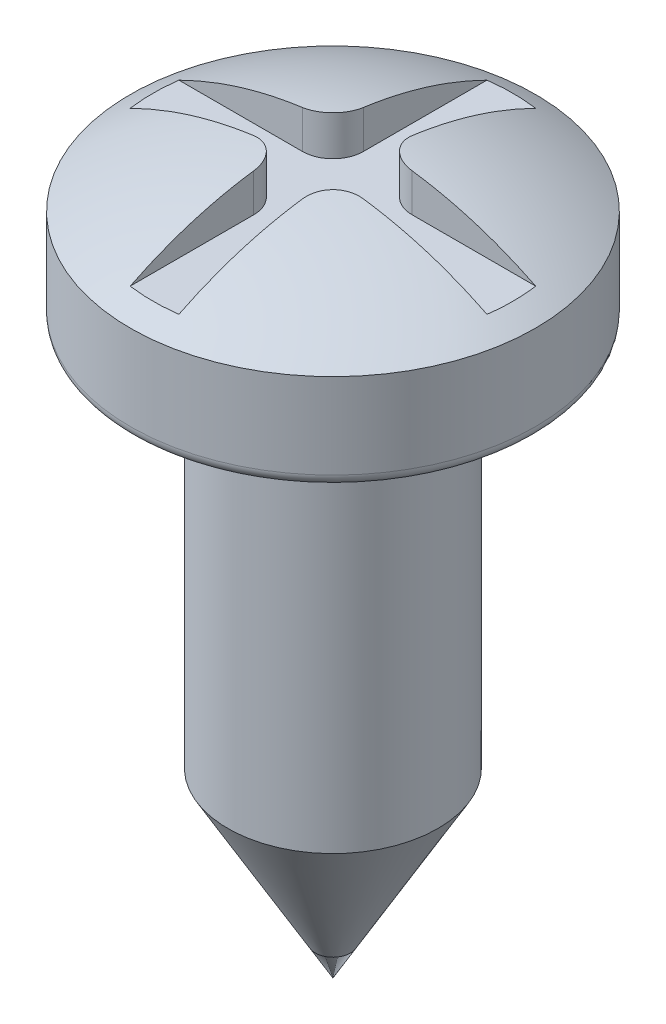
ISO-10303-21;
HEADER;
FILE_DESCRIPTION(('STEP AP214'),'2;1');
FILE_NAME('part.step','',(''),(''),'','','');
FILE_SCHEMA(('AUTOMOTIVE_DESIGN { 1 0 10303 214 1 1 1 1 }'));
ENDSEC;
DATA;
#1=APPLICATION_CONTEXT('core data for automotive mechanical design processes');
#2=APPLICATION_PROTOCOL_DEFINITION('international standard','automotive_design',2000,#1);
#3=PRODUCT_CONTEXT('',#1,'mechanical');
#4=PRODUCT('Part','Part','',(#3));
#5=PRODUCT_RELATED_PRODUCT_CATEGORY('part','',(#4));
#6=PRODUCT_DEFINITION_FORMATION('','',#4);
#7=PRODUCT_DEFINITION_CONTEXT('part definition',#1,'design');
#8=PRODUCT_DEFINITION('design','',#6,#7);
#9=PRODUCT_DEFINITION_SHAPE('','',#8);
#10=(LENGTH_UNIT() NAMED_UNIT(*) SI_UNIT(.MILLI.,.METRE.));
#11=(NAMED_UNIT(*) PLANE_ANGLE_UNIT() SI_UNIT($,.RADIAN.));
#12=(NAMED_UNIT(*) SI_UNIT($,.STERADIAN.) SOLID_ANGLE_UNIT());
#13=UNCERTAINTY_MEASURE_WITH_UNIT(LENGTH_MEASURE(1.E-05),#10,'distance_accuracy_value','');
#14=(GEOMETRIC_REPRESENTATION_CONTEXT(3) GLOBAL_UNCERTAINTY_ASSIGNED_CONTEXT((#13)) GLOBAL_UNIT_ASSIGNED_CONTEXT((#10,
#11,#12)) REPRESENTATION_CONTEXT('',''));
#15=CARTESIAN_POINT('',(0.,0.,0.));
#16=DIRECTION('',(0.,0.,1.));
#17=DIRECTION('',(1.,0.,0.));
#18=AXIS2_PLACEMENT_3D('',#15,#16,#17);
#19=CARTESIAN_POINT('',(0.,0.,0.));
#20=DIRECTION('',(0.,1.,0.));
#21=DIRECTION('',(-1.,0.,0.));
#22=AXIS2_PLACEMENT_3D('',#19,#20,#21);
#23=CONICAL_SURFACE('',#22,0.,0.523598775598293);
#24=CARTESIAN_POINT('',(0.,2.98778764305636,0.));
#25=DIRECTION('',(0.,-1.,0.));
#26=DIRECTION('',(1.,0.,0.));
#27=AXIS2_PLACEMENT_3D('',#24,#25,#26);
#28=CIRCLE('',#27,1.725);
#29=CARTESIAN_POINT('',(1.725,2.98778764305636,0.));
#30=VERTEX_POINT('',#29);
#31=EDGE_CURVE('E247',#30,#30,#28,.T.);
#32=ORIENTED_EDGE('',*,*,#31,.T.);
#33=EDGE_LOOP('',(#32));
#34=FACE_BOUND('',#33,.T.);
#35=CARTESIAN_POINT('',(0.,0.,0.));
#36=VERTEX_POINT('',#35);
#37=VERTEX_LOOP('',#36);
#38=FACE_BOUND('',#37,.T.);
#39=ADVANCED_FACE('F38',(#34,#38),#23,.T.);
#40=CARTESIAN_POINT('',(0.,0.,0.));
#41=DIRECTION('',(0.,-1.,0.));
#42=DIRECTION('',(1.,0.,0.));
#43=AXIS2_PLACEMENT_3D('',#40,#41,#42);
#44=CYLINDRICAL_SURFACE('',#43,1.725);
#45=CARTESIAN_POINT('',(0.,9.3,0.));
#46=DIRECTION('',(0.,-1.,0.));
#47=DIRECTION('',(1.,0.,0.));
#48=AXIS2_PLACEMENT_3D('',#45,#46,#47);
#49=CIRCLE('',#48,1.725);
#50=CARTESIAN_POINT('',(1.725,9.3,0.));
#51=VERTEX_POINT('',#50);
#52=EDGE_CURVE('E243',#51,#51,#49,.T.);
#53=ORIENTED_EDGE('',*,*,#52,.T.);
#54=EDGE_LOOP('',(#53));
#55=FACE_BOUND('',#54,.T.);
#56=ORIENTED_EDGE('',*,*,#31,.F.);
#57=EDGE_LOOP('',(#56));
#58=FACE_BOUND('',#57,.T.);
#59=ADVANCED_FACE('F329',(#55,#58),#44,.T.);
#60=CARTESIAN_POINT('',(3.125,9.3,0.));
#61=DIRECTION('',(0.,-1.,0.));
#62=DIRECTION('',(1.,0.,0.));
#63=AXIS2_PLACEMENT_3D('',#60,#61,#62);
#64=PLANE('',#63);
#65=CARTESIAN_POINT('',(0.,9.3,0.));
#66=DIRECTION('',(0.,-1.,0.));
#67=DIRECTION('',(1.,0.,0.));
#68=AXIS2_PLACEMENT_3D('',#65,#66,#67);
#69=CIRCLE('',#68,3.125);
#70=CARTESIAN_POINT('',(3.125,9.3,0.));
#71=VERTEX_POINT('',#70);
#72=EDGE_CURVE('E239',#71,#71,#69,.T.);
#73=ORIENTED_EDGE('',*,*,#72,.T.);
#74=EDGE_LOOP('',(#73));
#75=FACE_BOUND('',#74,.T.);
#76=ORIENTED_EDGE('',*,*,#52,.F.);
#77=EDGE_LOOP('',(#76));
#78=FACE_BOUND('',#77,.T.);
#79=ADVANCED_FACE('F334',(#75,#78),#64,.T.);
#80=CARTESIAN_POINT('',(0.,9.5,0.));
#81=DIRECTION('',(0.,-1.,0.));
#82=DIRECTION('',(1.,0.,0.));
#83=AXIS2_PLACEMENT_3D('',#80,#81,#82);
#84=TOROIDAL_SURFACE('',#83,3.125,0.200000000000001);
#85=CARTESIAN_POINT('',(0.,9.5,0.));
#86=DIRECTION('',(0.,-1.,0.));
#87=DIRECTION('',(1.,0.,0.));
#88=AXIS2_PLACEMENT_3D('',#85,#86,#87);
#89=CIRCLE('',#88,3.325);
#90=CARTESIAN_POINT('',(3.325,9.5,0.));
#91=VERTEX_POINT('',#90);
#92=EDGE_CURVE('E235',#91,#91,#89,.T.);
#93=ORIENTED_EDGE('',*,*,#92,.T.);
#94=EDGE_LOOP('',(#93));
#95=FACE_BOUND('',#94,.T.);
#96=ORIENTED_EDGE('',*,*,#72,.F.);
#97=EDGE_LOOP('',(#96));
#98=FACE_BOUND('',#97,.T.);
#99=ADVANCED_FACE('F341',(#95,#98),#84,.T.);
#100=CARTESIAN_POINT('',(0.,0.,0.));
#101=DIRECTION('',(0.,-1.,0.));
#102=DIRECTION('',(1.,0.,0.));
#103=AXIS2_PLACEMENT_3D('',#100,#101,#102);
#104=CYLINDRICAL_SURFACE('',#103,3.325);
#105=CARTESIAN_POINT('',(0.,10.9,0.));
#106=DIRECTION('',(0.,-1.,0.));
#107=DIRECTION('',(1.,0.,0.));
#108=AXIS2_PLACEMENT_3D('',#105,#106,#107);
#109=CIRCLE('',#108,3.325);
#110=CARTESIAN_POINT('',(3.325,10.9,0.));
#111=VERTEX_POINT('',#110);
#112=EDGE_CURVE('E215',#111,#111,#109,.T.);
#113=ORIENTED_EDGE('',*,*,#112,.T.);
#114=EDGE_LOOP('',(#113));
#115=FACE_BOUND('',#114,.T.);
#116=ORIENTED_EDGE('',*,*,#92,.F.);
#117=EDGE_LOOP('',(#116));
#118=FACE_BOUND('',#117,.T.);
#119=ADVANCED_FACE('F346',(#115,#118),#104,.T.);
#120=CARTESIAN_POINT('',(0.,5.20798611111109,0.));
#121=DIRECTION('',(0.,-1.,0.));
#122=DIRECTION('',(1.,0.,0.));
#123=AXIS2_PLACEMENT_3D('',#120,#121,#122);
#124=SPHERICAL_SURFACE('',#123,6.59201388888891);
#125=CARTESIAN_POINT('',(0.,11.1,0.));
#126=DIRECTION('',(0.,-1.,0.));
#127=DIRECTION('',(0.,0.,-1.));
#128=AXIS2_PLACEMENT_3D('',#125,#126,#127);
#129=CIRCLE('',#128,2.9561494286393);
#130=CARTESIAN_POINT('',(-2.92896217873233,11.1,-0.4));
#131=VERTEX_POINT('',#130);
#132=CARTESIAN_POINT('',(-2.92896217873233,11.1,0.4));
#133=VERTEX_POINT('',#132);
#134=EDGE_CURVE('E11',#131,#133,#129,.F.);
#135=ORIENTED_EDGE('',*,*,#134,.F.);
#136=CARTESIAN_POINT('',(0.,5.20798611111109,-0.4));
#137=DIRECTION('',(0.,0.,-1.));
#138=DIRECTION('',(-1.,0.,0.));
#139=AXIS2_PLACEMENT_3D('',#136,#137,#138);
#140=CIRCLE('',#139,6.57986680042266);
#141=CARTESIAN_POINT('',(-0.900000000000004,11.7260108971413,-0.4));
#142=VERTEX_POINT('',#141);
#143=EDGE_CURVE('E41',#142,#131,#140,.F.);
#144=ORIENTED_EDGE('',*,*,#143,.F.);
#145=CARTESIAN_POINT('',(-0.400000040000002,11.7259832758316,-0.900200000000003));
#146=CARTESIAN_POINT('',(-0.399964302893069,11.7298192962777,-0.872454147386038));
#147=CARTESIAN_POINT('',(-0.402286195456468,11.7333328197662,-0.844662243231787));
#148=CARTESIAN_POINT('',(-0.411514871642758,11.7396274742449,-0.789773061416488));
#149=CARTESIAN_POINT('',(-0.418420422207348,11.7424088019235,-0.762675598977974));
#150=CARTESIAN_POINT('',(-0.436694287015601,11.7471559318876,-0.709922826840037));
#151=CARTESIAN_POINT('',(-0.448066564077081,11.749121006811,-0.68426882092428));
#152=CARTESIAN_POINT('',(-0.474960733491131,11.7521725680326,-0.635190983387495));
#153=CARTESIAN_POINT('',(-0.490481074808829,11.7532593821181,-0.611766322605347));
#154=CARTESIAN_POINT('',(-0.525061326747513,11.7545153460377,-0.568051162184408));
#155=CARTESIAN_POINT('',(-0.544084001997458,11.7546936307443,-0.54773146443042));
#156=CARTESIAN_POINT('',(-0.58522961840174,11.754151736038,-0.510527488982345));
#157=CARTESIAN_POINT('',(-0.607352973876009,11.7534314364524,-0.49364367113882));
#158=CARTESIAN_POINT('',(-0.653948418928321,11.75111970967,-0.463857768893193));
#159=CARTESIAN_POINT('',(-0.67840942332194,11.7495322405111,-0.450938006585495));
#160=CARTESIAN_POINT('',(-0.729065979450149,11.7455357623251,-0.429320485749481));
#161=CARTESIAN_POINT('',(-0.755261021952667,11.7431269936328,-0.420621493910509));
#162=CARTESIAN_POINT('',(-0.801334520556133,11.738321808112,-0.409424849277442));
#163=CARTESIAN_POINT('',(-0.820984927089783,11.7361015729072,-0.405882524040746));
#164=CARTESIAN_POINT('',(-0.860496066936339,11.7313028815926,-0.401165692973559));
#165=CARTESIAN_POINT('',(-0.880356460382565,11.728724940796,-0.399987817994607));
#166=CARTESIAN_POINT('',(-0.900200000000004,11.7259832758316,-0.400000040000002));
#167=B_SPLINE_CURVE_WITH_KNOTS('',3,(#145,#146,#147,#148,#149,#150,#151,#152,#153,#154,#155,
#156,#157,#158,#159,#160,#161,#162,#163,#164,#165,#166),.UNSPECIFIED.,.F.,.F.,(4,2,2,2,2,2,2,2,
2,2,4),(0.,0.0839315261995667,0.167840482970046,0.251824051366389,0.3357762606434,
0.418882677380967,0.50200020959279,0.584741498895499,0.667458596581764,0.727591986383147,
0.787639630020283),.UNSPECIFIED.);
#168=CARTESIAN_POINT('',(-0.400000000000001,11.7260108971413,-0.900000000000004));
#169=VERTEX_POINT('',#168);
#170=EDGE_CURVE('E296',#169,#142,#167,.T.);
#171=ORIENTED_EDGE('',*,*,#170,.F.);
#172=CARTESIAN_POINT('',(-0.400000000000001,5.20798611111109,0.));
#173=DIRECTION('',(-1.,0.,0.));
#174=DIRECTION('',(0.,0.,1.));
#175=AXIS2_PLACEMENT_3D('',#172,#173,#174);
#176=CIRCLE('',#175,6.57986680042266);
#177=CARTESIAN_POINT('',(-0.4,11.1,-2.92896217873233));
#178=VERTEX_POINT('',#177);
#179=EDGE_CURVE('E252',#178,#169,#176,.F.);
#180=ORIENTED_EDGE('',*,*,#179,.F.);
#181=CARTESIAN_POINT('',(0.399999999999999,11.1,-2.92896217873233));
#182=VERTEX_POINT('',#181);
#183=EDGE_CURVE('E48',#182,#178,#129,.F.);
#184=ORIENTED_EDGE('',*,*,#183,.F.);
#185=CARTESIAN_POINT('',(0.399999999999999,5.20798611111109,0.));
#186=DIRECTION('',(1.,0.,0.));
#187=DIRECTION('',(0.,0.,-1.));
#188=AXIS2_PLACEMENT_3D('',#185,#186,#187);
#189=CIRCLE('',#188,6.57986680042266);
#190=CARTESIAN_POINT('',(0.399999999999999,11.7260108971413,-0.900000000000004));
#191=VERTEX_POINT('',#190);
#192=EDGE_CURVE('E256',#191,#182,#189,.F.);
#193=ORIENTED_EDGE('',*,*,#192,.F.);
#194=CARTESIAN_POINT('',(0.900200000000002,11.7259832758316,-0.400000040000002));
#195=CARTESIAN_POINT('',(0.872454147386037,11.7298192962777,-0.399964302893068));
#196=CARTESIAN_POINT('',(0.844662243231786,11.7333328197662,-0.402286195456467));
#197=CARTESIAN_POINT('',(0.789773061416487,11.7396274742449,-0.411514871642758));
#198=CARTESIAN_POINT('',(0.762675598977973,11.7424088019235,-0.418420422207347));
#199=CARTESIAN_POINT('',(0.709922826840036,11.7471559318876,-0.4366942870156));
#200=CARTESIAN_POINT('',(0.684268820924279,11.749121006811,-0.44806656407708));
#201=CARTESIAN_POINT('',(0.635190983387494,11.7521725680326,-0.47496073349113));
#202=CARTESIAN_POINT('',(0.611766322605346,11.7532593821181,-0.490481074808828));
#203=CARTESIAN_POINT('',(0.568051162184407,11.7545153460377,-0.525061326747512));
#204=CARTESIAN_POINT('',(0.547731464430418,11.7546936307443,-0.544084001997457));
#205=CARTESIAN_POINT('',(0.510527488982344,11.754151736038,-0.585229618401739));
#206=CARTESIAN_POINT('',(0.493643671138819,11.7534314364524,-0.607352973876008));
#207=CARTESIAN_POINT('',(0.463857768893192,11.75111970967,-0.65394841892832));
#208=CARTESIAN_POINT('',(0.450938006585494,11.7495322405111,-0.67840942332194));
#209=CARTESIAN_POINT('',(0.42932048574948,11.7455357623251,-0.729065979450149));
#210=CARTESIAN_POINT('',(0.420621493910507,11.7431269936328,-0.755261021952666));
#211=CARTESIAN_POINT('',(0.409424849277441,11.738321808112,-0.801334520556132));
#212=CARTESIAN_POINT('',(0.405882524040745,11.7361015729072,-0.820984927089783));
#213=CARTESIAN_POINT('',(0.401165692973558,11.7313028815926,-0.860496066936338));
#214=CARTESIAN_POINT('',(0.399987817994606,11.728724940796,-0.880356460382564));
#215=CARTESIAN_POINT('',(0.400000040000001,11.7259832758316,-0.900200000000003));
#216=B_SPLINE_CURVE_WITH_KNOTS('',3,(#194,#195,#196,#197,#198,#199,#200,#201,#202,#203,#204,
#205,#206,#207,#208,#209,#210,#211,#212,#213,#214,#215),.UNSPECIFIED.,.F.,.F.,(4,2,2,2,2,2,2,2,
2,2,4),(0.,0.0839315261995668,0.167840482970046,0.251824051366389,0.3357762606434,
0.418882677380967,0.50200020959279,0.584741498895499,0.667458596581764,0.727591986383148,
0.787639630020283),.UNSPECIFIED.);
#217=CARTESIAN_POINT('',(0.900000000000003,11.7260108971413,-0.4));
#218=VERTEX_POINT('',#217);
#219=EDGE_CURVE('E259',#218,#191,#216,.T.);
#220=ORIENTED_EDGE('',*,*,#219,.F.);
#221=CARTESIAN_POINT('',(0.,5.20798611111109,-0.4));
#222=DIRECTION('',(0.,0.,-1.));
#223=DIRECTION('',(-1.,0.,0.));
#224=AXIS2_PLACEMENT_3D('',#221,#222,#223);
#225=CIRCLE('',#224,6.57986680042266);
#226=CARTESIAN_POINT('',(2.92896217873233,11.1,-0.4));
#227=VERTEX_POINT('',#226);
#228=EDGE_CURVE('E267',#227,#218,#225,.F.);
#229=ORIENTED_EDGE('',*,*,#228,.F.);
#230=CARTESIAN_POINT('',(2.92896217873233,11.1,0.4));
#231=VERTEX_POINT('',#230);
#232=EDGE_CURVE('E253',#231,#227,#129,.F.);
#233=ORIENTED_EDGE('',*,*,#232,.F.);
#234=CARTESIAN_POINT('',(0.,5.20798611111109,0.4));
#235=DIRECTION('',(0.,0.,1.));
#236=DIRECTION('',(1.,0.,0.));
#237=AXIS2_PLACEMENT_3D('',#234,#235,#236);
#238=CIRCLE('',#237,6.57986680042266);
#239=CARTESIAN_POINT('',(0.900000000000003,11.7260108971413,0.4));
#240=VERTEX_POINT('',#239);
#241=EDGE_CURVE('E302',#240,#231,#238,.F.);
#242=ORIENTED_EDGE('',*,*,#241,.F.);
#243=CARTESIAN_POINT('',(0.400000040000001,11.7259832758316,0.900200000000003));
#244=CARTESIAN_POINT('',(0.399964302893068,11.7298192962777,0.872454147386038));
#245=CARTESIAN_POINT('',(0.402286195456467,11.7333328197662,0.844662243231787));
#246=CARTESIAN_POINT('',(0.411514871642757,11.7396274742449,0.789773061416488));
#247=CARTESIAN_POINT('',(0.418420422207347,11.7424088019235,0.762675598977974));
#248=CARTESIAN_POINT('',(0.436694287015599,11.7471559318876,0.709922826840037));
#249=CARTESIAN_POINT('',(0.448066564077079,11.749121006811,0.684268820924279));
#250=CARTESIAN_POINT('',(0.474960733491129,11.7521725680326,0.635190983387495));
#251=CARTESIAN_POINT('',(0.490481074808828,11.7532593821181,0.611766322605347));
#252=CARTESIAN_POINT('',(0.525061326747512,11.7545153460377,0.568051162184408));
#253=CARTESIAN_POINT('',(0.544084001997457,11.7546936307443,0.547731464430419));
#254=CARTESIAN_POINT('',(0.585229618401738,11.754151736038,0.510527488982345));
#255=CARTESIAN_POINT('',(0.607352973876008,11.7534314364524,0.49364367113882));
#256=CARTESIAN_POINT('',(0.653948418928319,11.75111970967,0.463857768893193));
#257=CARTESIAN_POINT('',(0.678409423321939,11.7495322405111,0.450938006585495));
#258=CARTESIAN_POINT('',(0.729065979450148,11.7455357623251,0.429320485749481));
#259=CARTESIAN_POINT('',(0.755261021952665,11.7431269936328,0.420621493910508));
#260=CARTESIAN_POINT('',(0.801334520556131,11.738321808112,0.409424849277442));
#261=CARTESIAN_POINT('',(0.820984927089782,11.7361015729072,0.405882524040746));
#262=CARTESIAN_POINT('',(0.860496066936337,11.7313028815926,0.401165692973559));
#263=CARTESIAN_POINT('',(0.880356460382563,11.728724940796,0.399987817994607));
#264=CARTESIAN_POINT('',(0.900200000000003,11.7259832758316,0.400000040000002));
#265=B_SPLINE_CURVE_WITH_KNOTS('',3,(#243,#244,#245,#246,#247,#248,#249,#250,#251,#252,#253,
#254,#255,#256,#257,#258,#259,#260,#261,#262,#263,#264),.UNSPECIFIED.,.F.,.F.,(4,2,2,2,2,2,2,2,
2,2,4),(0.,0.0839315261995667,0.167840482970046,0.251824051366389,0.3357762606434,
0.418882677380966,0.50200020959279,0.584741498895499,0.667458596581764,0.727591986383147,
0.787639630020283),.UNSPECIFIED.);
#266=CARTESIAN_POINT('',(0.399999999999999,11.7260108971413,0.900000000000004));
#267=VERTEX_POINT('',#266);
#268=EDGE_CURVE('E305',#267,#240,#265,.T.);
#269=ORIENTED_EDGE('',*,*,#268,.F.);
#270=CARTESIAN_POINT('',(0.4,5.20798611111109,0.));
#271=DIRECTION('',(1.,0.,0.));
#272=DIRECTION('',(0.,0.,-1.));
#273=AXIS2_PLACEMENT_3D('',#270,#271,#272);
#274=CIRCLE('',#273,6.57986680042266);
#275=CARTESIAN_POINT('',(0.399999999999999,11.1,2.92896217873233));
#276=VERTEX_POINT('',#275);
#277=EDGE_CURVE('E312',#276,#267,#274,.F.);
#278=ORIENTED_EDGE('',*,*,#277,.F.);
#279=CARTESIAN_POINT('',(-0.400000000000001,11.1,2.92896217873233));
#280=VERTEX_POINT('',#279);
#281=EDGE_CURVE('E47',#280,#276,#129,.F.);
#282=ORIENTED_EDGE('',*,*,#281,.F.);
#283=CARTESIAN_POINT('',(-0.4,5.20798611111109,0.));
#284=DIRECTION('',(-1.,0.,0.));
#285=DIRECTION('',(0.,0.,1.));
#286=AXIS2_PLACEMENT_3D('',#283,#284,#285);
#287=CIRCLE('',#286,6.57986680042266);
#288=CARTESIAN_POINT('',(-0.4,11.7260108971413,0.900000000000004));
#289=VERTEX_POINT('',#288);
#290=EDGE_CURVE('E165',#289,#280,#287,.F.);
#291=ORIENTED_EDGE('',*,*,#290,.F.);
#292=CARTESIAN_POINT('',(-0.900200000000004,11.7259832758316,0.400000040000002));
#293=CARTESIAN_POINT('',(-0.872454147386038,11.7298192962777,0.399964302893068));
#294=CARTESIAN_POINT('',(-0.844662243231787,11.7333328197662,0.402286195456467));
#295=CARTESIAN_POINT('',(-0.789773061416488,11.7396274742449,0.411514871642758));
#296=CARTESIAN_POINT('',(-0.762675598977974,11.7424088019235,0.418420422207347));
#297=CARTESIAN_POINT('',(-0.709922826840037,11.7471559318876,0.4366942870156));
#298=CARTESIAN_POINT('',(-0.68426882092428,11.749121006811,0.44806656407708));
#299=CARTESIAN_POINT('',(-0.635190983387495,11.7521725680326,0.47496073349113));
#300=CARTESIAN_POINT('',(-0.611766322605348,11.7532593821181,0.490481074808828));
#301=CARTESIAN_POINT('',(-0.568051162184408,11.7545153460377,0.525061326747512));
#302=CARTESIAN_POINT('',(-0.54773146443042,11.7546936307443,0.544084001997457));
#303=CARTESIAN_POINT('',(-0.510527488982345,11.754151736038,0.585229618401739));
#304=CARTESIAN_POINT('',(-0.49364367113882,11.7534314364524,0.607352973876008));
#305=CARTESIAN_POINT('',(-0.463857768893193,11.75111970967,0.65394841892832));
#306=CARTESIAN_POINT('',(-0.450938006585496,11.7495322405111,0.678409423321939));
#307=CARTESIAN_POINT('',(-0.429320485749481,11.7455357623251,0.729065979450148));
#308=CARTESIAN_POINT('',(-0.420621493910509,11.7431269936328,0.755261021952666));
#309=CARTESIAN_POINT('',(-0.409424849277443,11.738321808112,0.801334520556132));
#310=CARTESIAN_POINT('',(-0.405882524040746,11.7361015729072,0.820984927089782));
#311=CARTESIAN_POINT('',(-0.40116569297356,11.7313028815926,0.860496066936338));
#312=CARTESIAN_POINT('',(-0.399987817994607,11.728724940796,0.880356460382564));
#313=CARTESIAN_POINT('',(-0.400000040000002,11.7259832758316,0.900200000000003));
#314=B_SPLINE_CURVE_WITH_KNOTS('',3,(#292,#293,#294,#295,#296,#297,#298,#299,#300,#301,#302,
#303,#304,#305,#306,#307,#308,#309,#310,#311,#312,#313),.UNSPECIFIED.,.F.,.F.,(4,2,2,2,2,2,2,2,
2,2,4),(0.,0.0839315261995668,0.167840482970046,0.251824051366388,0.3357762606434,
0.418882677380966,0.50200020959279,0.584741498895499,0.667458596581764,0.727591986383147,
0.787639630020283),.UNSPECIFIED.);
#315=CARTESIAN_POINT('',(-0.900000000000004,11.7260108971413,0.4));
#316=VERTEX_POINT('',#315);
#317=EDGE_CURVE('E155',#316,#289,#314,.T.);
#318=ORIENTED_EDGE('',*,*,#317,.F.);
#319=CARTESIAN_POINT('',(0.,5.20798611111109,0.4));
#320=DIRECTION('',(0.,0.,1.));
#321=DIRECTION('',(1.,0.,0.));
#322=AXIS2_PLACEMENT_3D('',#319,#320,#321);
#323=CIRCLE('',#322,6.57986680042266);
#324=EDGE_CURVE('E370',#133,#316,#323,.F.);
#325=ORIENTED_EDGE('',*,*,#324,.F.);
#326=EDGE_LOOP('',(#135,#144,#171,#180,#184,#193,#220,#229,#233,#242,#269,#278,#282,#291,#318,#325));
#327=FACE_BOUND('',#326,.T.);
#328=ORIENTED_EDGE('',*,*,#112,.F.);
#329=EDGE_LOOP('',(#328));
#330=FACE_BOUND('',#329,.T.);
#331=ADVANCED_FACE('F269',(#327,#330),#124,.T.);
#332=CARTESIAN_POINT('',(0.399999999999999,14.1,0.900000000000004));
#333=DIRECTION('',(1.,0.,0.));
#334=DIRECTION('',(0.,0.,-1.));
#335=AXIS2_PLACEMENT_3D('',#332,#333,#334);
#336=PLANE('',#335);
#337=ORIENTED_EDGE('',*,*,#277,.T.);
#338=DIRECTION('',(0.,-1.,0.));
#339=VECTOR('',#338,1.);
#340=CARTESIAN_POINT('',(0.399999999999999,14.1,0.900000000000004));
#341=LINE('',#340,#339);
#342=CARTESIAN_POINT('',(0.399999999999999,11.1,0.900000000000004));
#343=VERTEX_POINT('',#342);
#344=EDGE_CURVE('E212',#267,#343,#341,.T.);
#345=ORIENTED_EDGE('',*,*,#344,.T.);
#346=DIRECTION('',(0.,0.,1.));
#347=VECTOR('',#346,1.);
#348=CARTESIAN_POINT('',(0.399999999999999,11.1,0.900000000000004));
#349=LINE('',#348,#347);
#350=EDGE_CURVE('E160',#343,#276,#349,.T.);
#351=ORIENTED_EDGE('',*,*,#350,.T.);
#352=EDGE_LOOP('',(#337,#345,#351));
#353=FACE_BOUND('',#352,.T.);
#354=ADVANCED_FACE('F319',(#353),#336,.F.);
#355=CARTESIAN_POINT('',(0.899999999999999,14.1,0.9));
#356=DIRECTION('',(0.,-1.,0.));
#357=DIRECTION('',(0.,0.,-1.));
#358=AXIS2_PLACEMENT_3D('',#355,#356,#357);
#359=CYLINDRICAL_SURFACE('',#358,0.5);
#360=ORIENTED_EDGE('',*,*,#268,.T.);
#361=DIRECTION('',(0.,-1.,0.));
#362=VECTOR('',#361,1.);
#363=CARTESIAN_POINT('',(0.900000000000003,14.1,0.4));
#364=LINE('',#363,#362);
#365=CARTESIAN_POINT('',(0.900000000000003,11.1,0.4));
#366=VERTEX_POINT('',#365);
#367=EDGE_CURVE('E216',#240,#366,#364,.T.);
#368=ORIENTED_EDGE('',*,*,#367,.T.);
#369=CARTESIAN_POINT('',(0.899999999999999,11.1,0.9));
#370=DIRECTION('',(0.,1.,0.));
#371=DIRECTION('',(0.,0.,1.));
#372=AXIS2_PLACEMENT_3D('',#369,#370,#371);
#373=CIRCLE('',#372,0.5);
#374=EDGE_CURVE('E205',#366,#343,#373,.T.);
#375=ORIENTED_EDGE('',*,*,#374,.T.);
#376=ORIENTED_EDGE('',*,*,#344,.F.);
#377=EDGE_LOOP('',(#360,#368,#375,#376));
#378=FACE_BOUND('',#377,.T.);
#379=ADVANCED_FACE('F314',(#378),#359,.T.);
#380=CARTESIAN_POINT('',(3.2,14.1,0.4));
#381=DIRECTION('',(0.,0.,1.));
#382=DIRECTION('',(1.,0.,0.));
#383=AXIS2_PLACEMENT_3D('',#380,#381,#382);
#384=PLANE('',#383);
#385=ORIENTED_EDGE('',*,*,#241,.T.);
#386=DIRECTION('',(-1.,0.,0.));
#387=VECTOR('',#386,1.);
#388=CARTESIAN_POINT('',(3.2,11.1,0.4));
#389=LINE('',#388,#387);
#390=EDGE_CURVE('E201',#231,#366,#389,.T.);
#391=ORIENTED_EDGE('',*,*,#390,.T.);
#392=ORIENTED_EDGE('',*,*,#367,.F.);
#393=EDGE_LOOP('',(#385,#391,#392));
#394=FACE_BOUND('',#393,.T.);
#395=ADVANCED_FACE('F318',(#394),#384,.F.);
#396=CARTESIAN_POINT('',(0.900000000000003,14.1,-0.4));
#397=DIRECTION('',(0.,0.,-1.));
#398=DIRECTION('',(-1.,0.,0.));
#399=AXIS2_PLACEMENT_3D('',#396,#397,#398);
#400=PLANE('',#399);
#401=ORIENTED_EDGE('',*,*,#228,.T.);
#402=DIRECTION('',(0.,-1.,0.));
#403=VECTOR('',#402,1.);
#404=CARTESIAN_POINT('',(0.900000000000003,14.1,-0.4));
#405=LINE('',#404,#403);
#406=CARTESIAN_POINT('',(0.900000000000003,11.1,-0.4));
#407=VERTEX_POINT('',#406);
#408=EDGE_CURVE('E219',#218,#407,#405,.T.);
#409=ORIENTED_EDGE('',*,*,#408,.T.);
#410=DIRECTION('',(1.,0.,0.));
#411=VECTOR('',#410,1.);
#412=CARTESIAN_POINT('',(0.900000000000003,11.1,-0.4));
#413=LINE('',#412,#411);
#414=EDGE_CURVE('E197',#407,#227,#413,.T.);
#415=ORIENTED_EDGE('',*,*,#414,.T.);
#416=EDGE_LOOP('',(#401,#409,#415));
#417=FACE_BOUND('',#416,.T.);
#418=ADVANCED_FACE('F279',(#417),#400,.F.);
#419=CARTESIAN_POINT('',(0.899999999999999,14.1,-0.9));
#420=DIRECTION('',(0.,-1.,0.));
#421=DIRECTION('',(0.,0.,-1.));
#422=AXIS2_PLACEMENT_3D('',#419,#420,#421);
#423=CYLINDRICAL_SURFACE('',#422,0.5);
#424=ORIENTED_EDGE('',*,*,#219,.T.);
#425=DIRECTION('',(0.,-1.,0.));
#426=VECTOR('',#425,1.);
#427=CARTESIAN_POINT('',(0.399999999999999,14.1,-0.900000000000004));
#428=LINE('',#427,#426);
#429=CARTESIAN_POINT('',(0.399999999999999,11.1,-0.900000000000004));
#430=VERTEX_POINT('',#429);
#431=EDGE_CURVE('E221',#191,#430,#428,.T.);
#432=ORIENTED_EDGE('',*,*,#431,.T.);
#433=CARTESIAN_POINT('',(0.899999999999999,11.1,-0.9));
#434=DIRECTION('',(0.,1.,0.));
#435=DIRECTION('',(0.,0.,1.));
#436=AXIS2_PLACEMENT_3D('',#433,#434,#435);
#437=CIRCLE('',#436,0.5);
#438=EDGE_CURVE('E193',#430,#407,#437,.T.);
#439=ORIENTED_EDGE('',*,*,#438,.T.);
#440=ORIENTED_EDGE('',*,*,#408,.F.);
#441=EDGE_LOOP('',(#424,#432,#439,#440));
#442=FACE_BOUND('',#441,.T.);
#443=ADVANCED_FACE('F273',(#442),#423,.T.);
#444=CARTESIAN_POINT('',(0.399999999999999,14.1,-3.2));
#445=DIRECTION('',(1.,0.,0.));
#446=DIRECTION('',(0.,0.,-1.));
#447=AXIS2_PLACEMENT_3D('',#444,#445,#446);
#448=PLANE('',#447);
#449=ORIENTED_EDGE('',*,*,#192,.T.);
#450=DIRECTION('',(0.,0.,1.));
#451=VECTOR('',#450,1.);
#452=CARTESIAN_POINT('',(0.399999999999999,11.1,-3.2));
#453=LINE('',#452,#451);
#454=EDGE_CURVE('E57',#182,#430,#453,.T.);
#455=ORIENTED_EDGE('',*,*,#454,.T.);
#456=ORIENTED_EDGE('',*,*,#431,.F.);
#457=EDGE_LOOP('',(#449,#455,#456));
#458=FACE_BOUND('',#457,.T.);
#459=ADVANCED_FACE('F278',(#458),#448,.F.);
#460=CARTESIAN_POINT('',(-0.400000000000001,14.1,-0.900000000000004));
#461=DIRECTION('',(-1.,0.,0.));
#462=DIRECTION('',(0.,0.,1.));
#463=AXIS2_PLACEMENT_3D('',#460,#461,#462);
#464=PLANE('',#463);
#465=ORIENTED_EDGE('',*,*,#179,.T.);
#466=DIRECTION('',(0.,-1.,0.));
#467=VECTOR('',#466,1.);
#468=CARTESIAN_POINT('',(-0.400000000000001,14.1,-0.900000000000004));
#469=LINE('',#468,#467);
#470=CARTESIAN_POINT('',(-0.400000000000001,11.1,-0.900000000000004));
#471=VERTEX_POINT('',#470);
#472=EDGE_CURVE('E224',#169,#471,#469,.T.);
#473=ORIENTED_EDGE('',*,*,#472,.T.);
#474=DIRECTION('',(0.,0.,-1.));
#475=VECTOR('',#474,1.);
#476=CARTESIAN_POINT('',(-0.400000000000001,11.1,-0.900000000000004));
#477=LINE('',#476,#475);
#478=EDGE_CURVE('E187',#471,#178,#477,.T.);
#479=ORIENTED_EDGE('',*,*,#478,.T.);
#480=EDGE_LOOP('',(#465,#473,#479));
#481=FACE_BOUND('',#480,.T.);
#482=ADVANCED_FACE('F284',(#481),#464,.F.);
#483=CARTESIAN_POINT('',(-0.900000000000001,14.1,-0.9));
#484=DIRECTION('',(0.,-1.,0.));
#485=DIRECTION('',(0.,0.,-1.));
#486=AXIS2_PLACEMENT_3D('',#483,#484,#485);
#487=CYLINDRICAL_SURFACE('',#486,0.5);
#488=ORIENTED_EDGE('',*,*,#170,.T.);
#489=DIRECTION('',(0.,-1.,0.));
#490=VECTOR('',#489,1.);
#491=CARTESIAN_POINT('',(-0.900000000000004,14.1,-0.4));
#492=LINE('',#491,#490);
#493=CARTESIAN_POINT('',(-0.900000000000004,11.1,-0.4));
#494=VERTEX_POINT('',#493);
#495=EDGE_CURVE('E227',#142,#494,#492,.T.);
#496=ORIENTED_EDGE('',*,*,#495,.T.);
#497=CARTESIAN_POINT('',(-0.900000000000001,11.1,-0.9));
#498=DIRECTION('',(0.,1.,0.));
#499=DIRECTION('',(0.,0.,-1.));
#500=AXIS2_PLACEMENT_3D('',#497,#498,#499);
#501=CIRCLE('',#500,0.5);
#502=EDGE_CURVE('E183',#494,#471,#501,.T.);
#503=ORIENTED_EDGE('',*,*,#502,.T.);
#504=ORIENTED_EDGE('',*,*,#472,.F.);
#505=EDGE_LOOP('',(#488,#496,#503,#504));
#506=FACE_BOUND('',#505,.T.);
#507=ADVANCED_FACE('F288',(#506),#487,.T.);
#508=CARTESIAN_POINT('',(-3.2,14.1,-0.4));
#509=DIRECTION('',(0.,0.,-1.));
#510=DIRECTION('',(-1.,0.,0.));
#511=AXIS2_PLACEMENT_3D('',#508,#509,#510);
#512=PLANE('',#511);
#513=ORIENTED_EDGE('',*,*,#143,.T.);
#514=DIRECTION('',(1.,0.,0.));
#515=VECTOR('',#514,1.);
#516=CARTESIAN_POINT('',(-3.2,11.1,-0.4));
#517=LINE('',#516,#515);
#518=EDGE_CURVE('E177',#131,#494,#517,.T.);
#519=ORIENTED_EDGE('',*,*,#518,.T.);
#520=ORIENTED_EDGE('',*,*,#495,.F.);
#521=EDGE_LOOP('',(#513,#519,#520));
#522=FACE_BOUND('',#521,.T.);
#523=ADVANCED_FACE('F293',(#522),#512,.F.);
#524=CARTESIAN_POINT('',(-0.900000000000004,14.1,0.4));
#525=DIRECTION('',(0.,0.,1.));
#526=DIRECTION('',(1.,0.,0.));
#527=AXIS2_PLACEMENT_3D('',#524,#525,#526);
#528=PLANE('',#527);
#529=ORIENTED_EDGE('',*,*,#324,.T.);
#530=DIRECTION('',(0.,-1.,0.));
#531=VECTOR('',#530,1.);
#532=CARTESIAN_POINT('',(-0.900000000000004,14.1,0.4));
#533=LINE('',#532,#531);
#534=CARTESIAN_POINT('',(-0.900000000000004,11.1,0.4));
#535=VERTEX_POINT('',#534);
#536=EDGE_CURVE('E159',#316,#535,#533,.T.);
#537=ORIENTED_EDGE('',*,*,#536,.T.);
#538=DIRECTION('',(-1.,0.,0.));
#539=VECTOR('',#538,1.);
#540=CARTESIAN_POINT('',(-0.900000000000004,11.1,0.4));
#541=LINE('',#540,#539);
#542=EDGE_CURVE('E172',#535,#133,#541,.T.);
#543=ORIENTED_EDGE('',*,*,#542,.T.);
#544=EDGE_LOOP('',(#529,#537,#543));
#545=FACE_BOUND('',#544,.T.);
#546=ADVANCED_FACE('F374',(#545),#528,.F.);
#547=CARTESIAN_POINT('',(-0.9,14.1,0.9));
#548=DIRECTION('',(0.,-1.,0.));
#549=DIRECTION('',(0.,0.,-1.));
#550=AXIS2_PLACEMENT_3D('',#547,#548,#549);
#551=CYLINDRICAL_SURFACE('',#550,0.5);
#552=ORIENTED_EDGE('',*,*,#317,.T.);
#553=DIRECTION('',(0.,-1.,0.));
#554=VECTOR('',#553,1.);
#555=CARTESIAN_POINT('',(-0.4,14.1,0.900000000000004));
#556=LINE('',#555,#554);
#557=CARTESIAN_POINT('',(-0.4,11.1,0.900000000000004));
#558=VERTEX_POINT('',#557);
#559=EDGE_CURVE('E148',#289,#558,#556,.T.);
#560=ORIENTED_EDGE('',*,*,#559,.T.);
#561=CARTESIAN_POINT('',(-0.9,11.1,0.9));
#562=DIRECTION('',(0.,1.,0.));
#563=DIRECTION('',(0.,0.,-1.));
#564=AXIS2_PLACEMENT_3D('',#561,#562,#563);
#565=CIRCLE('',#564,0.5);
#566=EDGE_CURVE('E153',#558,#535,#565,.T.);
#567=ORIENTED_EDGE('',*,*,#566,.T.);
#568=ORIENTED_EDGE('',*,*,#536,.F.);
#569=EDGE_LOOP('',(#552,#560,#567,#568));
#570=FACE_BOUND('',#569,.T.);
#571=ADVANCED_FACE('F150',(#570),#551,.T.);
#572=CARTESIAN_POINT('',(-0.400000000000001,14.1,3.2));
#573=DIRECTION('',(-1.,0.,0.));
#574=DIRECTION('',(0.,0.,1.));
#575=AXIS2_PLACEMENT_3D('',#572,#573,#574);
#576=PLANE('',#575);
#577=ORIENTED_EDGE('',*,*,#290,.T.);
#578=DIRECTION('',(0.,0.,-1.));
#579=VECTOR('',#578,1.);
#580=CARTESIAN_POINT('',(-0.400000000000001,11.1,3.2));
#581=LINE('',#580,#579);
#582=EDGE_CURVE('E163',#280,#558,#581,.T.);
#583=ORIENTED_EDGE('',*,*,#582,.T.);
#584=ORIENTED_EDGE('',*,*,#559,.F.);
#585=EDGE_LOOP('',(#577,#583,#584));
#586=FACE_BOUND('',#585,.T.);
#587=ADVANCED_FACE('F164',(#586),#576,.F.);
#588=CARTESIAN_POINT('',(-0.9,11.1,0.9));
#589=DIRECTION('',(0.,-1.,0.));
#590=DIRECTION('',(0.,0.,-1.));
#591=AXIS2_PLACEMENT_3D('',#588,#589,#590);
#592=PLANE('',#591);
#593=ORIENTED_EDGE('',*,*,#134,.T.);
#594=ORIENTED_EDGE('',*,*,#542,.F.);
#595=ORIENTED_EDGE('',*,*,#566,.F.);
#596=ORIENTED_EDGE('',*,*,#582,.F.);
#597=ORIENTED_EDGE('',*,*,#281,.T.);
#598=ORIENTED_EDGE('',*,*,#350,.F.);
#599=ORIENTED_EDGE('',*,*,#374,.F.);
#600=ORIENTED_EDGE('',*,*,#390,.F.);
#601=ORIENTED_EDGE('',*,*,#232,.T.);
#602=ORIENTED_EDGE('',*,*,#414,.F.);
#603=ORIENTED_EDGE('',*,*,#438,.F.);
#604=ORIENTED_EDGE('',*,*,#454,.F.);
#605=ORIENTED_EDGE('',*,*,#183,.T.);
#606=ORIENTED_EDGE('',*,*,#478,.F.);
#607=ORIENTED_EDGE('',*,*,#502,.F.);
#608=ORIENTED_EDGE('',*,*,#518,.F.);
#609=EDGE_LOOP('',(#593,#594,#595,#596,#597,#598,#599,#600,#601,#602,#603,#604,#605,#606,#607,#608));
#610=FACE_BOUND('',#609,.T.);
#611=ADVANCED_FACE('F170',(#610),#592,.F.);
#612=CLOSED_SHELL('',(#39,#59,#79,#99,#119,#331,#354,#379,#395,#418,#443,#459,#482,#507,#523,
#546,#571,#587,#611));
#613=MANIFOLD_SOLID_BREP('B2',#612);
#614=ADVANCED_BREP_SHAPE_REPRESENTATION('',(#18,#613),#14);
#615=SHAPE_DEFINITION_REPRESENTATION(#9,#614);
ENDSEC;
END-ISO-10303-21;
